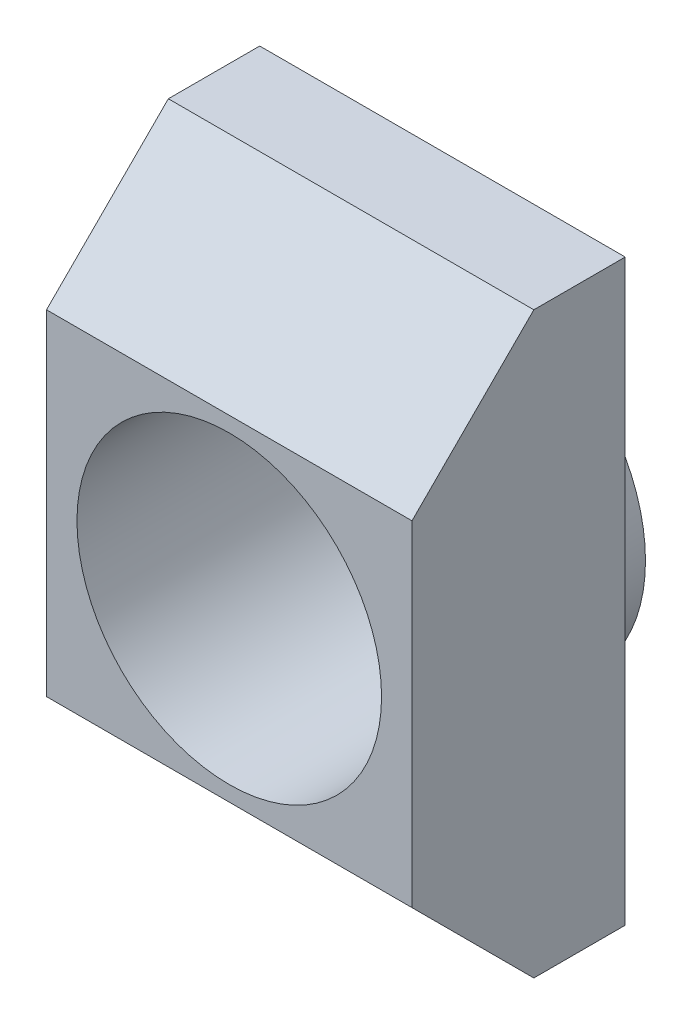
ISO-10303-21;
HEADER;
FILE_DESCRIPTION(('STEP AP214'),'2;1');
FILE_NAME('part.step','',(''),(''),'','','');
FILE_SCHEMA(('AUTOMOTIVE_DESIGN { 1 0 10303 214 1 1 1 1 }'));
ENDSEC;
DATA;
#1=APPLICATION_CONTEXT('core data for automotive mechanical design processes');
#2=APPLICATION_PROTOCOL_DEFINITION('international standard','automotive_design',2000,#1);
#3=PRODUCT_CONTEXT('',#1,'mechanical');
#4=PRODUCT('Part','Part','',(#3));
#5=PRODUCT_RELATED_PRODUCT_CATEGORY('part','',(#4));
#6=PRODUCT_DEFINITION_FORMATION('','',#4);
#7=PRODUCT_DEFINITION_CONTEXT('part definition',#1,'design');
#8=PRODUCT_DEFINITION('design','',#6,#7);
#9=PRODUCT_DEFINITION_SHAPE('','',#8);
#10=(LENGTH_UNIT() NAMED_UNIT(*) SI_UNIT(.MILLI.,.METRE.));
#11=(NAMED_UNIT(*) PLANE_ANGLE_UNIT() SI_UNIT($,.RADIAN.));
#12=(NAMED_UNIT(*) SI_UNIT($,.STERADIAN.) SOLID_ANGLE_UNIT());
#13=UNCERTAINTY_MEASURE_WITH_UNIT(LENGTH_MEASURE(1.E-05),#10,'distance_accuracy_value','');
#14=(GEOMETRIC_REPRESENTATION_CONTEXT(3) GLOBAL_UNCERTAINTY_ASSIGNED_CONTEXT((#13)) GLOBAL_UNIT_ASSIGNED_CONTEXT((#10,
#11,#12)) REPRESENTATION_CONTEXT('',''));
#15=CARTESIAN_POINT('',(0.,0.,0.));
#16=DIRECTION('',(0.,0.,1.));
#17=DIRECTION('',(1.,0.,0.));
#18=AXIS2_PLACEMENT_3D('',#15,#16,#17);
#19=CARTESIAN_POINT('',(0.,0.,2.92902435330802));
#20=DIRECTION('',(0.,0.,-1.));
#21=DIRECTION('',(-1.,0.,0.));
#22=AXIS2_PLACEMENT_3D('',#19,#20,#21);
#23=CYLINDRICAL_SURFACE('',#22,2.5);
#24=CARTESIAN_POINT('',(0.,0.,-1.4372505879018));
#25=DIRECTION('',(0.,0.,-1.));
#26=DIRECTION('',(-1.,0.,0.));
#27=AXIS2_PLACEMENT_3D('',#24,#25,#26);
#28=CIRCLE('',#27,2.5);
#29=CARTESIAN_POINT('',(-2.5,0.,-1.4372505879018));
#30=VERTEX_POINT('',#29);
#31=EDGE_CURVE('E84',#30,#30,#28,.F.);
#32=ORIENTED_EDGE('',*,*,#31,.F.);
#33=EDGE_LOOP('',(#32));
#34=FACE_BOUND('',#33,.T.);
#35=CARTESIAN_POINT('',(0.,0.,2.6627494120982));
#36=DIRECTION('',(0.,0.,-1.));
#37=DIRECTION('',(-1.,0.,0.));
#38=AXIS2_PLACEMENT_3D('',#35,#36,#37);
#39=CIRCLE('',#38,2.5);
#40=CARTESIAN_POINT('',(-2.5,0.,2.6627494120982));
#41=VERTEX_POINT('',#40);
#42=EDGE_CURVE('E20',#41,#41,#39,.F.);
#43=ORIENTED_EDGE('',*,*,#42,.T.);
#44=EDGE_LOOP('',(#43));
#45=FACE_BOUND('',#44,.T.);
#46=ADVANCED_FACE('F17',(#34,#45),#23,.F.);
#47=CARTESIAN_POINT('',(3.,4.75,0.662749412098202));
#48=DIRECTION('',(0.,-0.707106781186548,-0.707106781186548));
#49=DIRECTION('',(0.,0.707106781186548,-0.707106781186548));
#50=AXIS2_PLACEMENT_3D('',#47,#48,#49);
#51=PLANE('',#50);
#52=DIRECTION('',(-1.,0.,0.));
#53=VECTOR('',#52,1.);
#54=CARTESIAN_POINT('',(3.,2.75,2.6627494120982));
#55=LINE('',#54,#53);
#56=CARTESIAN_POINT('',(-3.,2.75,2.6627494120982));
#57=VERTEX_POINT('',#56);
#58=CARTESIAN_POINT('',(3.,2.75,2.6627494120982));
#59=VERTEX_POINT('',#58);
#60=EDGE_CURVE('E103',#57,#59,#55,.F.);
#61=ORIENTED_EDGE('',*,*,#60,.T.);
#62=DIRECTION('',(0.,-0.707106781186548,0.707106781186547));
#63=VECTOR('',#62,1.);
#64=CARTESIAN_POINT('',(3.,4.75,0.662749412098202));
#65=LINE('',#64,#63);
#66=CARTESIAN_POINT('',(3.,4.75,0.662749412098202));
#67=VERTEX_POINT('',#66);
#68=EDGE_CURVE('E67',#67,#59,#65,.T.);
#69=ORIENTED_EDGE('',*,*,#68,.F.);
#70=DIRECTION('',(1.,0.,0.));
#71=VECTOR('',#70,1.);
#72=CARTESIAN_POINT('',(3.,4.75,0.662749412098202));
#73=LINE('',#72,#71);
#74=CARTESIAN_POINT('',(-3.,4.75,0.662749412098202));
#75=VERTEX_POINT('',#74);
#76=EDGE_CURVE('E299',#67,#75,#73,.F.);
#77=ORIENTED_EDGE('',*,*,#76,.T.);
#78=DIRECTION('',(0.,-0.707106781186548,0.707106781186547));
#79=VECTOR('',#78,1.);
#80=CARTESIAN_POINT('',(-3.,4.75,0.662749412098202));
#81=LINE('',#80,#79);
#82=EDGE_CURVE('E308',#75,#57,#81,.T.);
#83=ORIENTED_EDGE('',*,*,#82,.T.);
#84=EDGE_LOOP('',(#61,#69,#77,#83));
#85=FACE_BOUND('',#84,.T.);
#86=ADVANCED_FACE('F116',(#85),#51,.F.);
#87=CARTESIAN_POINT('',(3.,2.75,2.6627494120982));
#88=DIRECTION('',(0.,0.,-1.));
#89=DIRECTION('',(-1.,0.,0.));
#90=AXIS2_PLACEMENT_3D('',#87,#88,#89);
#91=PLANE('',#90);
#92=DIRECTION('',(1.,0.,0.));
#93=VECTOR('',#92,1.);
#94=CARTESIAN_POINT('',(3.,-2.75,2.6627494120982));
#95=LINE('',#94,#93);
#96=CARTESIAN_POINT('',(-3.,-2.75,2.6627494120982));
#97=VERTEX_POINT('',#96);
#98=CARTESIAN_POINT('',(3.,-2.75,2.6627494120982));
#99=VERTEX_POINT('',#98);
#100=EDGE_CURVE('E101',#97,#99,#95,.T.);
#101=ORIENTED_EDGE('',*,*,#100,.T.);
#102=DIRECTION('',(0.,1.,0.));
#103=VECTOR('',#102,1.);
#104=CARTESIAN_POINT('',(3.,0.,2.6627494120982));
#105=LINE('',#104,#103);
#106=EDGE_CURVE('E90',#59,#99,#105,.F.);
#107=ORIENTED_EDGE('',*,*,#106,.F.);
#108=ORIENTED_EDGE('',*,*,#60,.F.);
#109=DIRECTION('',(0.,1.,0.));
#110=VECTOR('',#109,1.);
#111=CARTESIAN_POINT('',(-3.,0.,2.6627494120982));
#112=LINE('',#111,#110);
#113=EDGE_CURVE('E310',#57,#97,#112,.F.);
#114=ORIENTED_EDGE('',*,*,#113,.T.);
#115=EDGE_LOOP('',(#101,#107,#108,#114));
#116=FACE_BOUND('',#115,.T.);
#117=ORIENTED_EDGE('',*,*,#42,.F.);
#118=EDGE_LOOP('',(#117));
#119=FACE_BOUND('',#118,.T.);
#120=ADVANCED_FACE('F120',(#116,#119),#91,.F.);
#121=CARTESIAN_POINT('',(3.,-2.75,2.6627494120982));
#122=DIRECTION('',(0.,0.707106781186548,-0.707106781186548));
#123=DIRECTION('',(0.,0.707106781186548,0.707106781186548));
#124=AXIS2_PLACEMENT_3D('',#121,#122,#123);
#125=PLANE('',#124);
#126=DIRECTION('',(1.,0.,0.));
#127=VECTOR('',#126,1.);
#128=CARTESIAN_POINT('',(3.,-4.75,0.662749412098202));
#129=LINE('',#128,#127);
#130=CARTESIAN_POINT('',(-3.,-4.75,0.662749412098201));
#131=VERTEX_POINT('',#130);
#132=CARTESIAN_POINT('',(3.,-4.75,0.662749412098202));
#133=VERTEX_POINT('',#132);
#134=EDGE_CURVE('E73',#131,#133,#129,.T.);
#135=ORIENTED_EDGE('',*,*,#134,.T.);
#136=DIRECTION('',(0.,-0.707106781186548,-0.707106781186547));
#137=VECTOR('',#136,1.);
#138=CARTESIAN_POINT('',(3.,-2.75,2.6627494120982));
#139=LINE('',#138,#137);
#140=EDGE_CURVE('E76',#99,#133,#139,.T.);
#141=ORIENTED_EDGE('',*,*,#140,.F.);
#142=ORIENTED_EDGE('',*,*,#100,.F.);
#143=DIRECTION('',(0.,-0.707106781186548,-0.707106781186547));
#144=VECTOR('',#143,1.);
#145=CARTESIAN_POINT('',(-3.,-2.75,2.6627494120982));
#146=LINE('',#145,#144);
#147=EDGE_CURVE('E78',#97,#131,#146,.T.);
#148=ORIENTED_EDGE('',*,*,#147,.T.);
#149=EDGE_LOOP('',(#135,#141,#142,#148));
#150=FACE_BOUND('',#149,.T.);
#151=ADVANCED_FACE('F75',(#150),#125,.F.);
#152=CARTESIAN_POINT('',(0.,0.,-1.4372505879018));
#153=DIRECTION('',(0.,0.,-1.));
#154=DIRECTION('',(-1.,0.,0.));
#155=AXIS2_PLACEMENT_3D('',#152,#153,#154);
#156=PLANE('',#155);
#157=ORIENTED_EDGE('',*,*,#31,.T.);
#158=EDGE_LOOP('',(#157));
#159=FACE_BOUND('',#158,.T.);
#160=CARTESIAN_POINT('',(0.,0.,-1.4372505879018));
#161=DIRECTION('',(0.,0.,1.));
#162=DIRECTION('',(1.,0.,0.));
#163=AXIS2_PLACEMENT_3D('',#160,#161,#162);
#164=CIRCLE('',#163,2.7329159209683);
#165=CARTESIAN_POINT('',(2.7329159209683,0.,-1.4372505879018));
#166=VERTEX_POINT('',#165);
#167=EDGE_CURVE('E105',#166,#166,#164,.T.);
#168=ORIENTED_EDGE('',*,*,#167,.F.);
#169=EDGE_LOOP('',(#168));
#170=FACE_BOUND('',#169,.T.);
#171=ADVANCED_FACE('F111',(#159,#170),#156,.T.);
#172=CARTESIAN_POINT('',(3.,-4.75,0.662749412098202));
#173=DIRECTION('',(0.,1.,0.));
#174=DIRECTION('',(0.,0.,1.));
#175=AXIS2_PLACEMENT_3D('',#172,#173,#174);
#176=PLANE('',#175);
#177=DIRECTION('',(1.,0.,0.));
#178=VECTOR('',#177,1.);
#179=CARTESIAN_POINT('',(3.,-4.75,-0.837250587901798));
#180=LINE('',#179,#178);
#181=CARTESIAN_POINT('',(-3.,-4.75,-0.837250587901798));
#182=VERTEX_POINT('',#181);
#183=CARTESIAN_POINT('',(3.,-4.75,-0.837250587901798));
#184=VERTEX_POINT('',#183);
#185=EDGE_CURVE('E96',#182,#184,#180,.T.);
#186=ORIENTED_EDGE('',*,*,#185,.T.);
#187=DIRECTION('',(0.,0.,-1.));
#188=VECTOR('',#187,1.);
#189=CARTESIAN_POINT('',(3.,-4.75,0.));
#190=LINE('',#189,#188);
#191=EDGE_CURVE('E83',#133,#184,#190,.T.);
#192=ORIENTED_EDGE('',*,*,#191,.F.);
#193=ORIENTED_EDGE('',*,*,#134,.F.);
#194=DIRECTION('',(0.,0.,-1.));
#195=VECTOR('',#194,1.);
#196=CARTESIAN_POINT('',(-3.,-4.75,0.));
#197=LINE('',#196,#195);
#198=EDGE_CURVE('E107',#131,#182,#197,.T.);
#199=ORIENTED_EDGE('',*,*,#198,.T.);
#200=EDGE_LOOP('',(#186,#192,#193,#199));
#201=FACE_BOUND('',#200,.T.);
#202=ADVANCED_FACE('F95',(#201),#176,.F.);
#203=CARTESIAN_POINT('',(3.,0.,0.));
#204=DIRECTION('',(1.,0.,0.));
#205=DIRECTION('',(0.,0.,-1.));
#206=AXIS2_PLACEMENT_3D('',#203,#204,#205);
#207=PLANE('',#206);
#208=ORIENTED_EDGE('',*,*,#106,.T.);
#209=ORIENTED_EDGE('',*,*,#140,.T.);
#210=ORIENTED_EDGE('',*,*,#191,.T.);
#211=DIRECTION('',(0.,1.,0.));
#212=VECTOR('',#211,1.);
#213=CARTESIAN_POINT('',(3.,-4.75,-0.837250587901798));
#214=LINE('',#213,#212);
#215=CARTESIAN_POINT('',(3.,4.75,-0.837250587901798));
#216=VERTEX_POINT('',#215);
#217=EDGE_CURVE('E304',#184,#216,#214,.T.);
#218=ORIENTED_EDGE('',*,*,#217,.T.);
#219=DIRECTION('',(0.,0.,-1.));
#220=VECTOR('',#219,1.);
#221=CARTESIAN_POINT('',(3.,4.75,-0.837250587901798));
#222=LINE('',#221,#220);
#223=EDGE_CURVE('E92',#216,#67,#222,.F.);
#224=ORIENTED_EDGE('',*,*,#223,.T.);
#225=ORIENTED_EDGE('',*,*,#68,.T.);
#226=EDGE_LOOP('',(#208,#209,#210,#218,#224,#225));
#227=FACE_BOUND('',#226,.T.);
#228=ADVANCED_FACE('F86',(#227),#207,.T.);
#229=CARTESIAN_POINT('',(3.,4.75,-0.837250587901798));
#230=DIRECTION('',(0.,-1.,0.));
#231=DIRECTION('',(0.,0.,-1.));
#232=AXIS2_PLACEMENT_3D('',#229,#230,#231);
#233=PLANE('',#232);
#234=ORIENTED_EDGE('',*,*,#76,.F.);
#235=ORIENTED_EDGE('',*,*,#223,.F.);
#236=DIRECTION('',(1.,0.,0.));
#237=VECTOR('',#236,1.);
#238=CARTESIAN_POINT('',(3.,4.75,-0.837250587901798));
#239=LINE('',#238,#237);
#240=CARTESIAN_POINT('',(-3.,4.75,-0.837250587901798));
#241=VERTEX_POINT('',#240);
#242=EDGE_CURVE('E317',#216,#241,#239,.F.);
#243=ORIENTED_EDGE('',*,*,#242,.T.);
#244=DIRECTION('',(0.,0.,-1.));
#245=VECTOR('',#244,1.);
#246=CARTESIAN_POINT('',(-3.,4.75,0.));
#247=LINE('',#246,#245);
#248=EDGE_CURVE('E35',#241,#75,#247,.F.);
#249=ORIENTED_EDGE('',*,*,#248,.T.);
#250=EDGE_LOOP('',(#234,#235,#243,#249));
#251=FACE_BOUND('',#250,.T.);
#252=ADVANCED_FACE('F147',(#251),#233,.F.);
#253=CARTESIAN_POINT('',(-3.,0.,0.));
#254=DIRECTION('',(1.,0.,0.));
#255=DIRECTION('',(0.,0.,-1.));
#256=AXIS2_PLACEMENT_3D('',#253,#254,#255);
#257=PLANE('',#256);
#258=ORIENTED_EDGE('',*,*,#147,.F.);
#259=ORIENTED_EDGE('',*,*,#113,.F.);
#260=ORIENTED_EDGE('',*,*,#82,.F.);
#261=ORIENTED_EDGE('',*,*,#248,.F.);
#262=DIRECTION('',(0.,1.,0.));
#263=VECTOR('',#262,1.);
#264=CARTESIAN_POINT('',(-3.,-4.75,-0.837250587901798));
#265=LINE('',#264,#263);
#266=EDGE_CURVE('E26',#241,#182,#265,.F.);
#267=ORIENTED_EDGE('',*,*,#266,.T.);
#268=ORIENTED_EDGE('',*,*,#198,.F.);
#269=EDGE_LOOP('',(#258,#259,#260,#261,#267,#268));
#270=FACE_BOUND('',#269,.T.);
#271=ADVANCED_FACE('F139',(#270),#257,.F.);
#272=CARTESIAN_POINT('',(0.,0.,-1.4372505879018));
#273=DIRECTION('',(0.,0.,1.));
#274=DIRECTION('',(1.,0.,0.));
#275=AXIS2_PLACEMENT_3D('',#272,#273,#274);
#276=CYLINDRICAL_SURFACE('',#275,2.7329159209683);
#277=ORIENTED_EDGE('',*,*,#167,.T.);
#278=EDGE_LOOP('',(#277));
#279=FACE_BOUND('',#278,.T.);
#280=CARTESIAN_POINT('',(0.,0.,-0.837250587901798));
#281=DIRECTION('',(0.,0.,1.));
#282=DIRECTION('',(1.,0.,0.));
#283=AXIS2_PLACEMENT_3D('',#280,#281,#282);
#284=CIRCLE('',#283,2.7329159209683);
#285=CARTESIAN_POINT('',(2.7329159209683,0.,-0.837250587901798));
#286=VERTEX_POINT('',#285);
#287=EDGE_CURVE('E11',#286,#286,#284,.F.);
#288=ORIENTED_EDGE('',*,*,#287,.T.);
#289=EDGE_LOOP('',(#288));
#290=FACE_BOUND('',#289,.T.);
#291=ADVANCED_FACE('F133',(#279,#290),#276,.T.);
#292=CARTESIAN_POINT('',(3.,-4.75,-0.837250587901798));
#293=DIRECTION('',(0.,0.,1.));
#294=DIRECTION('',(1.,0.,0.));
#295=AXIS2_PLACEMENT_3D('',#292,#293,#294);
#296=PLANE('',#295);
#297=ORIENTED_EDGE('',*,*,#287,.F.);
#298=EDGE_LOOP('',(#297));
#299=FACE_BOUND('',#298,.T.);
#300=ORIENTED_EDGE('',*,*,#242,.F.);
#301=ORIENTED_EDGE('',*,*,#217,.F.);
#302=ORIENTED_EDGE('',*,*,#185,.F.);
#303=ORIENTED_EDGE('',*,*,#266,.F.);
#304=EDGE_LOOP('',(#300,#301,#302,#303));
#305=FACE_BOUND('',#304,.T.);
#306=ADVANCED_FACE('F131',(#299,#305),#296,.F.);
#307=CLOSED_SHELL('',(#46,#86,#120,#151,#171,#202,#228,#252,#271,#291,#306));
#308=MANIFOLD_SOLID_BREP('B1',#307);
#309=ADVANCED_BREP_SHAPE_REPRESENTATION('',(#18,#308),#14);
#310=SHAPE_DEFINITION_REPRESENTATION(#9,#309);
ENDSEC;
END-ISO-10303-21;
